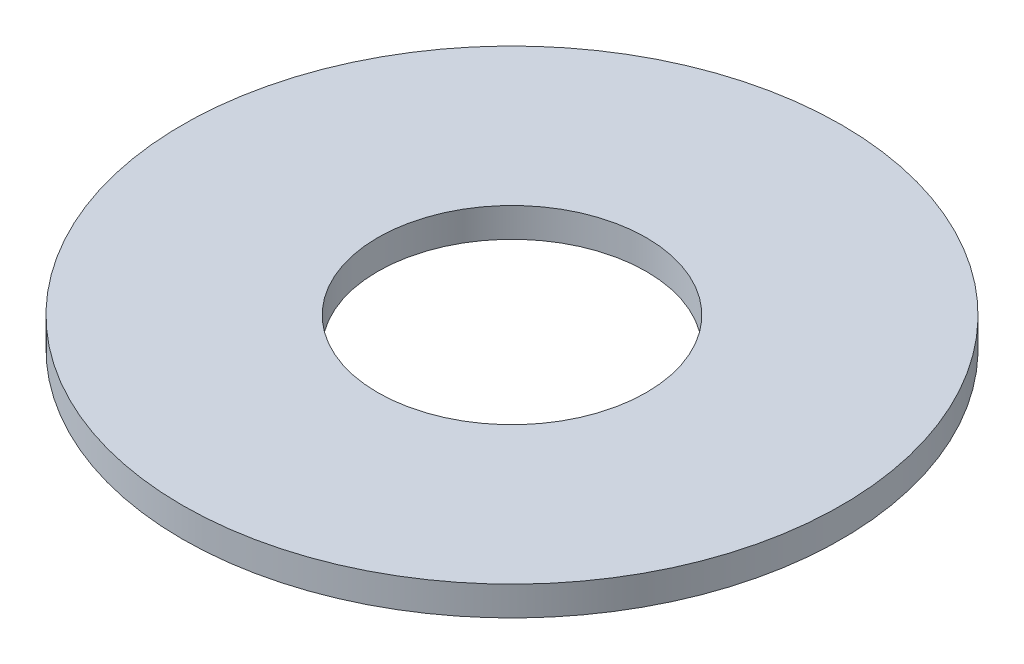
ISO-10303-21;
HEADER;
FILE_DESCRIPTION(('STEP AP214'),'2;1');
FILE_NAME('part.step','',(''),(''),'','','');
FILE_SCHEMA(('AUTOMOTIVE_DESIGN { 1 0 10303 214 1 1 1 1 }'));
ENDSEC;
DATA;
#1=APPLICATION_CONTEXT('core data for automotive mechanical design processes');
#2=APPLICATION_PROTOCOL_DEFINITION('international standard','automotive_design',2000,#1);
#3=PRODUCT_CONTEXT('',#1,'mechanical');
#4=PRODUCT('Part','Part','',(#3));
#5=PRODUCT_RELATED_PRODUCT_CATEGORY('part','',(#4));
#6=PRODUCT_DEFINITION_FORMATION('','',#4);
#7=PRODUCT_DEFINITION_CONTEXT('part definition',#1,'design');
#8=PRODUCT_DEFINITION('design','',#6,#7);
#9=PRODUCT_DEFINITION_SHAPE('','',#8);
#10=(LENGTH_UNIT() NAMED_UNIT(*) SI_UNIT(.MILLI.,.METRE.));
#11=(NAMED_UNIT(*) PLANE_ANGLE_UNIT() SI_UNIT($,.RADIAN.));
#12=(NAMED_UNIT(*) SI_UNIT($,.STERADIAN.) SOLID_ANGLE_UNIT());
#13=UNCERTAINTY_MEASURE_WITH_UNIT(LENGTH_MEASURE(1.E-05),#10,'distance_accuracy_value','');
#14=(GEOMETRIC_REPRESENTATION_CONTEXT(3) GLOBAL_UNCERTAINTY_ASSIGNED_CONTEXT((#13)) GLOBAL_UNIT_ASSIGNED_CONTEXT((#10,
#11,#12)) REPRESENTATION_CONTEXT('',''));
#15=CARTESIAN_POINT('',(0.,0.,0.));
#16=DIRECTION('',(0.,0.,1.));
#17=DIRECTION('',(1.,0.,0.));
#18=AXIS2_PLACEMENT_3D('',#15,#16,#17);
#19=CARTESIAN_POINT('',(0.,6.,0.));
#20=DIRECTION('',(0.,-1.,0.));
#21=DIRECTION('',(0.,0.,-1.));
#22=AXIS2_PLACEMENT_3D('',#19,#20,#21);
#23=CYLINDRICAL_SURFACE('',#22,67.5);
#24=CARTESIAN_POINT('',(0.,6.,0.));
#25=DIRECTION('',(0.,1.,0.));
#26=DIRECTION('',(0.,0.,1.));
#27=AXIS2_PLACEMENT_3D('',#24,#25,#26);
#28=CIRCLE('',#27,67.5);
#29=CARTESIAN_POINT('',(0.,6.,67.5));
#30=VERTEX_POINT('',#29);
#31=EDGE_CURVE('E10',#30,#30,#28,.T.);
#32=ORIENTED_EDGE('',*,*,#31,.F.);
#33=EDGE_LOOP('',(#32));
#34=FACE_BOUND('',#33,.T.);
#35=CARTESIAN_POINT('',(0.,0.,0.));
#36=DIRECTION('',(0.,1.,0.));
#37=DIRECTION('',(0.,0.,1.));
#38=AXIS2_PLACEMENT_3D('',#35,#36,#37);
#39=CIRCLE('',#38,67.5);
#40=CARTESIAN_POINT('',(0.,0.,67.5));
#41=VERTEX_POINT('',#40);
#42=EDGE_CURVE('E37',#41,#41,#39,.T.);
#43=ORIENTED_EDGE('',*,*,#42,.T.);
#44=EDGE_LOOP('',(#43));
#45=FACE_BOUND('',#44,.T.);
#46=ADVANCED_FACE('F40',(#34,#45),#23,.T.);
#47=CARTESIAN_POINT('',(0.,6.,0.));
#48=DIRECTION('',(0.,1.,0.));
#49=DIRECTION('',(0.,0.,1.));
#50=AXIS2_PLACEMENT_3D('',#47,#48,#49);
#51=PLANE('',#50);
#52=CARTESIAN_POINT('',(0.,6.,0.));
#53=DIRECTION('',(0.,1.,0.));
#54=DIRECTION('',(0.,0.,1.));
#55=AXIS2_PLACEMENT_3D('',#52,#53,#54);
#56=CIRCLE('',#55,27.5);
#57=CARTESIAN_POINT('',(0.,6.,27.5));
#58=VERTEX_POINT('',#57);
#59=EDGE_CURVE('E50',#58,#58,#56,.T.);
#60=ORIENTED_EDGE('',*,*,#59,.F.);
#61=EDGE_LOOP('',(#60));
#62=FACE_BOUND('',#61,.T.);
#63=ORIENTED_EDGE('',*,*,#31,.T.);
#64=EDGE_LOOP('',(#63));
#65=FACE_BOUND('',#64,.T.);
#66=ADVANCED_FACE('F59',(#62,#65),#51,.T.);
#67=CARTESIAN_POINT('',(0.,0.,0.));
#68=DIRECTION('',(0.,1.,0.));
#69=DIRECTION('',(0.,0.,1.));
#70=AXIS2_PLACEMENT_3D('',#67,#68,#69);
#71=PLANE('',#70);
#72=CARTESIAN_POINT('',(0.,0.,0.));
#73=DIRECTION('',(0.,1.,0.));
#74=DIRECTION('',(0.,0.,1.));
#75=AXIS2_PLACEMENT_3D('',#72,#73,#74);
#76=CIRCLE('',#75,27.5);
#77=CARTESIAN_POINT('',(0.,0.,27.5));
#78=VERTEX_POINT('',#77);
#79=EDGE_CURVE('E47',#78,#78,#76,.T.);
#80=ORIENTED_EDGE('',*,*,#79,.T.);
#81=EDGE_LOOP('',(#80));
#82=FACE_BOUND('',#81,.T.);
#83=ORIENTED_EDGE('',*,*,#42,.F.);
#84=EDGE_LOOP('',(#83));
#85=FACE_BOUND('',#84,.T.);
#86=ADVANCED_FACE('F58',(#82,#85),#71,.F.);
#87=CARTESIAN_POINT('',(0.,6.,0.));
#88=DIRECTION('',(0.,-1.,0.));
#89=DIRECTION('',(0.,0.,-1.));
#90=AXIS2_PLACEMENT_3D('',#87,#88,#89);
#91=CYLINDRICAL_SURFACE('',#90,27.5);
#92=ORIENTED_EDGE('',*,*,#59,.T.);
#93=EDGE_LOOP('',(#92));
#94=FACE_BOUND('',#93,.T.);
#95=ORIENTED_EDGE('',*,*,#79,.F.);
#96=EDGE_LOOP('',(#95));
#97=FACE_BOUND('',#96,.T.);
#98=ADVANCED_FACE('F54',(#94,#97),#91,.F.);
#99=CLOSED_SHELL('',(#46,#66,#86,#98));
#100=MANIFOLD_SOLID_BREP('B2',#99);
#101=ADVANCED_BREP_SHAPE_REPRESENTATION('',(#18,#100),#14);
#102=SHAPE_DEFINITION_REPRESENTATION(#9,#101);
ENDSEC;
END-ISO-10303-21;
